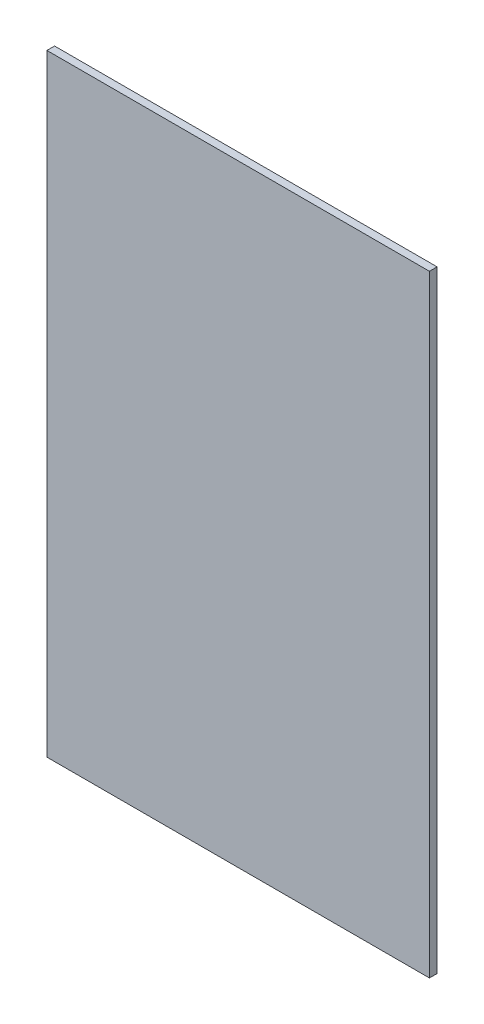
ISO-10303-21;
HEADER;
FILE_DESCRIPTION(('STEP AP214'),'2;1');
FILE_NAME('part.step','',(''),(''),'','','');
FILE_SCHEMA(('AUTOMOTIVE_DESIGN { 1 0 10303 214 1 1 1 1 }'));
ENDSEC;
DATA;
#1=APPLICATION_CONTEXT('core data for automotive mechanical design processes');
#2=APPLICATION_PROTOCOL_DEFINITION('international standard','automotive_design',2000,#1);
#3=PRODUCT_CONTEXT('',#1,'mechanical');
#4=PRODUCT('Part','Part','',(#3));
#5=PRODUCT_RELATED_PRODUCT_CATEGORY('part','',(#4));
#6=PRODUCT_DEFINITION_FORMATION('','',#4);
#7=PRODUCT_DEFINITION_CONTEXT('part definition',#1,'design');
#8=PRODUCT_DEFINITION('design','',#6,#7);
#9=PRODUCT_DEFINITION_SHAPE('','',#8);
#10=(LENGTH_UNIT() NAMED_UNIT(*) SI_UNIT(.MILLI.,.METRE.));
#11=(NAMED_UNIT(*) PLANE_ANGLE_UNIT() SI_UNIT($,.RADIAN.));
#12=(NAMED_UNIT(*) SI_UNIT($,.STERADIAN.) SOLID_ANGLE_UNIT());
#13=UNCERTAINTY_MEASURE_WITH_UNIT(LENGTH_MEASURE(1.E-05),#10,'distance_accuracy_value','');
#14=(GEOMETRIC_REPRESENTATION_CONTEXT(3) GLOBAL_UNCERTAINTY_ASSIGNED_CONTEXT((#13)) GLOBAL_UNIT_ASSIGNED_CONTEXT((#10,
#11,#12)) REPRESENTATION_CONTEXT('',''));
#15=CARTESIAN_POINT('',(0.,0.,0.));
#16=DIRECTION('',(0.,0.,1.));
#17=DIRECTION('',(1.,0.,0.));
#18=AXIS2_PLACEMENT_3D('',#15,#16,#17);
#19=CARTESIAN_POINT('',(-125.,-200.,5.));
#20=DIRECTION('',(0.,1.,0.));
#21=DIRECTION('',(-1.,0.,0.));
#22=AXIS2_PLACEMENT_3D('',#19,#20,#21);
#23=PLANE('',#22);
#24=DIRECTION('',(1.,0.,0.));
#25=VECTOR('',#24,1.);
#26=CARTESIAN_POINT('',(-125.,-200.,0.));
#27=LINE('',#26,#25);
#28=CARTESIAN_POINT('',(-125.,-200.,0.));
#29=VERTEX_POINT('',#28);
#30=CARTESIAN_POINT('',(125.,-200.,0.));
#31=VERTEX_POINT('',#30);
#32=EDGE_CURVE('E98',#29,#31,#27,.T.);
#33=ORIENTED_EDGE('',*,*,#32,.T.);
#34=DIRECTION('',(0.,0.,-1.));
#35=VECTOR('',#34,1.);
#36=CARTESIAN_POINT('',(125.,-200.,5.));
#37=LINE('',#36,#35);
#38=CARTESIAN_POINT('',(125.,-200.,5.));
#39=VERTEX_POINT('',#38);
#40=EDGE_CURVE('E11',#39,#31,#37,.T.);
#41=ORIENTED_EDGE('',*,*,#40,.F.);
#42=DIRECTION('',(1.,0.,0.));
#43=VECTOR('',#42,1.);
#44=CARTESIAN_POINT('',(-125.,-200.,5.));
#45=LINE('',#44,#43);
#46=CARTESIAN_POINT('',(-125.,-200.,5.));
#47=VERTEX_POINT('',#46);
#48=EDGE_CURVE('E86',#47,#39,#45,.T.);
#49=ORIENTED_EDGE('',*,*,#48,.F.);
#50=DIRECTION('',(0.,0.,-1.));
#51=VECTOR('',#50,1.);
#52=CARTESIAN_POINT('',(-125.,-200.,5.));
#53=LINE('',#52,#51);
#54=EDGE_CURVE('E94',#47,#29,#53,.T.);
#55=ORIENTED_EDGE('',*,*,#54,.T.);
#56=EDGE_LOOP('',(#33,#41,#49,#55));
#57=FACE_BOUND('',#56,.T.);
#58=ADVANCED_FACE('F35',(#57),#23,.F.);
#59=CARTESIAN_POINT('',(125.,-200.,5.));
#60=DIRECTION('',(-1.,0.,0.));
#61=DIRECTION('',(0.,0.,1.));
#62=AXIS2_PLACEMENT_3D('',#59,#60,#61);
#63=PLANE('',#62);
#64=DIRECTION('',(0.,1.,0.));
#65=VECTOR('',#64,1.);
#66=CARTESIAN_POINT('',(125.,-200.,0.));
#67=LINE('',#66,#65);
#68=CARTESIAN_POINT('',(125.,200.,0.));
#69=VERTEX_POINT('',#68);
#70=EDGE_CURVE('E90',#31,#69,#67,.T.);
#71=ORIENTED_EDGE('',*,*,#70,.T.);
#72=DIRECTION('',(0.,0.,-1.));
#73=VECTOR('',#72,1.);
#74=CARTESIAN_POINT('',(125.,200.,5.));
#75=LINE('',#74,#73);
#76=CARTESIAN_POINT('',(125.,200.,5.));
#77=VERTEX_POINT('',#76);
#78=EDGE_CURVE('E43',#77,#69,#75,.T.);
#79=ORIENTED_EDGE('',*,*,#78,.F.);
#80=DIRECTION('',(0.,1.,0.));
#81=VECTOR('',#80,1.);
#82=CARTESIAN_POINT('',(125.,-200.,5.));
#83=LINE('',#82,#81);
#84=EDGE_CURVE('E81',#39,#77,#83,.T.);
#85=ORIENTED_EDGE('',*,*,#84,.F.);
#86=ORIENTED_EDGE('',*,*,#40,.T.);
#87=EDGE_LOOP('',(#71,#79,#85,#86));
#88=FACE_BOUND('',#87,.T.);
#89=ADVANCED_FACE('F89',(#88),#63,.F.);
#90=CARTESIAN_POINT('',(-125.,200.,5.));
#91=DIRECTION('',(0.,-1.,0.));
#92=DIRECTION('',(1.,0.,0.));
#93=AXIS2_PLACEMENT_3D('',#90,#91,#92);
#94=PLANE('',#93);
#95=DIRECTION('',(-1.,0.,0.));
#96=VECTOR('',#95,1.);
#97=CARTESIAN_POINT('',(-125.,200.,0.));
#98=LINE('',#97,#96);
#99=CARTESIAN_POINT('',(-125.,200.,0.));
#100=VERTEX_POINT('',#99);
#101=EDGE_CURVE('E68',#69,#100,#98,.T.);
#102=ORIENTED_EDGE('',*,*,#101,.T.);
#103=DIRECTION('',(0.,0.,-1.));
#104=VECTOR('',#103,1.);
#105=CARTESIAN_POINT('',(-125.,200.,5.));
#106=LINE('',#105,#104);
#107=CARTESIAN_POINT('',(-125.,200.,5.));
#108=VERTEX_POINT('',#107);
#109=EDGE_CURVE('E91',#108,#100,#106,.T.);
#110=ORIENTED_EDGE('',*,*,#109,.F.);
#111=DIRECTION('',(-1.,0.,0.));
#112=VECTOR('',#111,1.);
#113=CARTESIAN_POINT('',(-125.,200.,5.));
#114=LINE('',#113,#112);
#115=EDGE_CURVE('E84',#77,#108,#114,.T.);
#116=ORIENTED_EDGE('',*,*,#115,.F.);
#117=ORIENTED_EDGE('',*,*,#78,.T.);
#118=EDGE_LOOP('',(#102,#110,#116,#117));
#119=FACE_BOUND('',#118,.T.);
#120=ADVANCED_FACE('F92',(#119),#94,.F.);
#121=CARTESIAN_POINT('',(-125.,-200.,5.));
#122=DIRECTION('',(1.,0.,0.));
#123=DIRECTION('',(0.,0.,-1.));
#124=AXIS2_PLACEMENT_3D('',#121,#122,#123);
#125=PLANE('',#124);
#126=DIRECTION('',(0.,-1.,0.));
#127=VECTOR('',#126,1.);
#128=CARTESIAN_POINT('',(-125.,-200.,0.));
#129=LINE('',#128,#127);
#130=EDGE_CURVE('E74',#100,#29,#129,.T.);
#131=ORIENTED_EDGE('',*,*,#130,.T.);
#132=ORIENTED_EDGE('',*,*,#54,.F.);
#133=DIRECTION('',(0.,-1.,0.));
#134=VECTOR('',#133,1.);
#135=CARTESIAN_POINT('',(-125.,-200.,5.));
#136=LINE('',#135,#134);
#137=EDGE_CURVE('E51',#108,#47,#136,.T.);
#138=ORIENTED_EDGE('',*,*,#137,.F.);
#139=ORIENTED_EDGE('',*,*,#109,.T.);
#140=EDGE_LOOP('',(#131,#132,#138,#139));
#141=FACE_BOUND('',#140,.T.);
#142=ADVANCED_FACE('F105',(#141),#125,.F.);
#143=CARTESIAN_POINT('',(0.,0.,5.));
#144=DIRECTION('',(0.,0.,1.));
#145=DIRECTION('',(1.,0.,0.));
#146=AXIS2_PLACEMENT_3D('',#143,#144,#145);
#147=PLANE('',#146);
#148=ORIENTED_EDGE('',*,*,#48,.T.);
#149=ORIENTED_EDGE('',*,*,#84,.T.);
#150=ORIENTED_EDGE('',*,*,#115,.T.);
#151=ORIENTED_EDGE('',*,*,#137,.T.);
#152=EDGE_LOOP('',(#148,#149,#150,#151));
#153=FACE_BOUND('',#152,.T.);
#154=ADVANCED_FACE('F82',(#153),#147,.T.);
#155=CARTESIAN_POINT('',(0.,0.,0.));
#156=DIRECTION('',(0.,0.,1.));
#157=DIRECTION('',(1.,0.,0.));
#158=AXIS2_PLACEMENT_3D('',#155,#156,#157);
#159=PLANE('',#158);
#160=ORIENTED_EDGE('',*,*,#32,.F.);
#161=ORIENTED_EDGE('',*,*,#130,.F.);
#162=ORIENTED_EDGE('',*,*,#101,.F.);
#163=ORIENTED_EDGE('',*,*,#70,.F.);
#164=EDGE_LOOP('',(#160,#161,#162,#163));
#165=FACE_BOUND('',#164,.T.);
#166=ADVANCED_FACE('F108',(#165),#159,.F.);
#167=CLOSED_SHELL('',(#58,#89,#120,#142,#154,#166));
#168=MANIFOLD_SOLID_BREP('B2',#167);
#169=ADVANCED_BREP_SHAPE_REPRESENTATION('',(#18,#168),#14);
#170=SHAPE_DEFINITION_REPRESENTATION(#9,#169);
ENDSEC;
END-ISO-10303-21;
